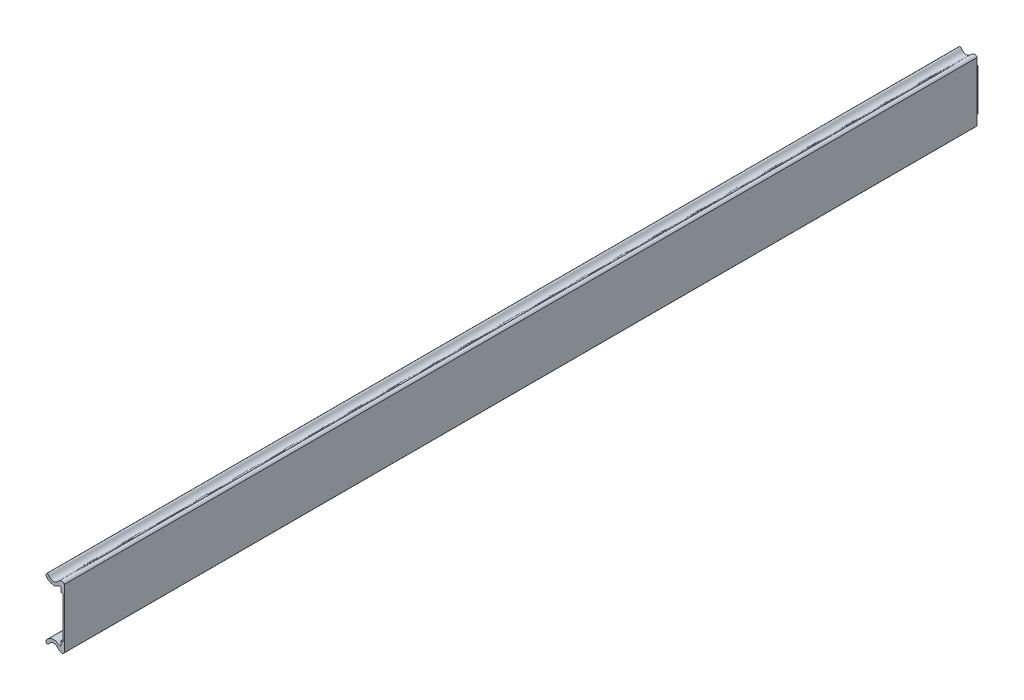
ISO-10303-21;
HEADER;
FILE_DESCRIPTION(('STEP AP214'),'2;1');
FILE_NAME('part.step','',(''),(''),'','','');
FILE_SCHEMA(('AUTOMOTIVE_DESIGN { 1 0 10303 214 1 1 1 1 }'));
ENDSEC;
DATA;
#1=APPLICATION_CONTEXT('core data for automotive mechanical design processes');
#2=APPLICATION_PROTOCOL_DEFINITION('international standard','automotive_design',2000,#1);
#3=PRODUCT_CONTEXT('',#1,'mechanical');
#4=PRODUCT('Part','Part','',(#3));
#5=PRODUCT_RELATED_PRODUCT_CATEGORY('part','',(#4));
#6=PRODUCT_DEFINITION_FORMATION('','',#4);
#7=PRODUCT_DEFINITION_CONTEXT('part definition',#1,'design');
#8=PRODUCT_DEFINITION('design','',#6,#7);
#9=PRODUCT_DEFINITION_SHAPE('','',#8);
#10=(LENGTH_UNIT() NAMED_UNIT(*) SI_UNIT(.MILLI.,.METRE.));
#11=(NAMED_UNIT(*) PLANE_ANGLE_UNIT() SI_UNIT($,.RADIAN.));
#12=(NAMED_UNIT(*) SI_UNIT($,.STERADIAN.) SOLID_ANGLE_UNIT());
#13=UNCERTAINTY_MEASURE_WITH_UNIT(LENGTH_MEASURE(1.E-05),#10,'distance_accuracy_value','');
#14=(GEOMETRIC_REPRESENTATION_CONTEXT(3) GLOBAL_UNCERTAINTY_ASSIGNED_CONTEXT((#13)) GLOBAL_UNIT_ASSIGNED_CONTEXT((#10,
#11,#12)) REPRESENTATION_CONTEXT('',''));
#15=CARTESIAN_POINT('',(0.,0.,0.));
#16=DIRECTION('',(0.,0.,1.));
#17=DIRECTION('',(1.,0.,0.));
#18=AXIS2_PLACEMENT_3D('',#15,#16,#17);
#19=CARTESIAN_POINT('',(12.3955232876,0.,-0.8));
#20=DIRECTION('',(-1.,0.,0.));
#21=DIRECTION('',(0.,0.,1.));
#22=AXIS2_PLACEMENT_3D('',#19,#20,#21);
#23=PLANE('',#22);
#24=DIRECTION('',(0.,-1.,0.));
#25=VECTOR('',#24,1.);
#26=CARTESIAN_POINT('',(12.3955232876,0.,0.));
#27=LINE('',#26,#25);
#28=CARTESIAN_POINT('',(12.3955232876,3944.3764480689,0.));
#29=VERTEX_POINT('',#28);
#30=CARTESIAN_POINT('',(12.3955232876,3928.5229508506,0.));
#31=VERTEX_POINT('',#30);
#32=EDGE_CURVE('E115',#29,#31,#27,.T.);
#33=ORIENTED_EDGE('',*,*,#32,.T.);
#34=DIRECTION('',(0.,0.,1.));
#35=VECTOR('',#34,1.);
#36=CARTESIAN_POINT('',(12.3955232876,3928.5229508506,-0.8));
#37=LINE('',#36,#35);
#38=CARTESIAN_POINT('',(12.3955232876,3928.5229508506,-0.8));
#39=VERTEX_POINT('',#38);
#40=EDGE_CURVE('E12',#39,#31,#37,.T.);
#41=ORIENTED_EDGE('',*,*,#40,.F.);
#42=DIRECTION('',(0.,-1.,0.));
#43=VECTOR('',#42,1.);
#44=CARTESIAN_POINT('',(12.3955232876,0.,-0.8));
#45=LINE('',#44,#43);
#46=CARTESIAN_POINT('',(12.3955232876,3944.3764480689,-0.8));
#47=VERTEX_POINT('',#46);
#48=EDGE_CURVE('E110',#47,#39,#45,.T.);
#49=ORIENTED_EDGE('',*,*,#48,.F.);
#50=DIRECTION('',(0.,0.,1.));
#51=VECTOR('',#50,1.);
#52=CARTESIAN_POINT('',(12.3955232876,3944.3764480689,-0.8));
#53=LINE('',#52,#51);
#54=EDGE_CURVE('E54',#47,#29,#53,.T.);
#55=ORIENTED_EDGE('',*,*,#54,.T.);
#56=EDGE_LOOP('',(#33,#41,#49,#55));
#57=FACE_BOUND('',#56,.T.);
#58=ADVANCED_FACE('F51',(#57),#23,.F.);
#59=CARTESIAN_POINT('',(0.,3928.5229508506,-0.8));
#60=DIRECTION('',(0.,1.,0.));
#61=DIRECTION('',(0.,0.,1.));
#62=AXIS2_PLACEMENT_3D('',#59,#60,#61);
#63=PLANE('',#62);
#64=DIRECTION('',(-1.,0.,0.));
#65=VECTOR('',#64,1.);
#66=CARTESIAN_POINT('',(0.,3928.5229508506,0.));
#67=LINE('',#66,#65);
#68=CARTESIAN_POINT('',(4.8646294528,3928.5229508506,0.));
#69=VERTEX_POINT('',#68);
#70=EDGE_CURVE('E90',#31,#69,#67,.T.);
#71=ORIENTED_EDGE('',*,*,#70,.T.);
#72=DIRECTION('',(0.,0.,1.));
#73=VECTOR('',#72,1.);
#74=CARTESIAN_POINT('',(4.8646294528,3928.5229508506,-0.8));
#75=LINE('',#74,#73);
#76=CARTESIAN_POINT('',(4.8646294528,3928.5229508506,-0.8));
#77=VERTEX_POINT('',#76);
#78=EDGE_CURVE('E60',#77,#69,#75,.T.);
#79=ORIENTED_EDGE('',*,*,#78,.F.);
#80=DIRECTION('',(-1.,0.,0.));
#81=VECTOR('',#80,1.);
#82=CARTESIAN_POINT('',(0.,3928.5229508506,-0.8));
#83=LINE('',#82,#81);
#84=EDGE_CURVE('E68',#39,#77,#83,.T.);
#85=ORIENTED_EDGE('',*,*,#84,.F.);
#86=ORIENTED_EDGE('',*,*,#40,.T.);
#87=EDGE_LOOP('',(#71,#79,#85,#86));
#88=FACE_BOUND('',#87,.T.);
#89=ADVANCED_FACE('F122',(#88),#63,.F.);
#90=CARTESIAN_POINT('',(4.8646294528,0.,-0.8));
#91=DIRECTION('',(-1.,0.,0.));
#92=DIRECTION('',(0.,0.,1.));
#93=AXIS2_PLACEMENT_3D('',#90,#91,#92);
#94=PLANE('',#93);
#95=DIRECTION('',(0.,-1.,0.));
#96=VECTOR('',#95,1.);
#97=CARTESIAN_POINT('',(4.8646294528,0.,0.));
#98=LINE('',#97,#96);
#99=CARTESIAN_POINT('',(4.8646294528,3944.3764480689,0.));
#100=VERTEX_POINT('',#99);
#101=EDGE_CURVE('E102',#100,#69,#98,.T.);
#102=ORIENTED_EDGE('',*,*,#101,.F.);
#103=DIRECTION('',(0.,0.,1.));
#104=VECTOR('',#103,1.);
#105=CARTESIAN_POINT('',(4.8646294528,3944.3764480689,-0.8));
#106=LINE('',#105,#104);
#107=CARTESIAN_POINT('',(4.8646294528,3944.3764480689,-0.8));
#108=VERTEX_POINT('',#107);
#109=EDGE_CURVE('E98',#108,#100,#106,.T.);
#110=ORIENTED_EDGE('',*,*,#109,.F.);
#111=DIRECTION('',(0.,-1.,0.));
#112=VECTOR('',#111,1.);
#113=CARTESIAN_POINT('',(4.8646294528,0.,-0.8));
#114=LINE('',#113,#112);
#115=EDGE_CURVE('E101',#108,#77,#114,.T.);
#116=ORIENTED_EDGE('',*,*,#115,.T.);
#117=ORIENTED_EDGE('',*,*,#78,.T.);
#118=EDGE_LOOP('',(#102,#110,#116,#117));
#119=FACE_BOUND('',#118,.T.);
#120=ADVANCED_FACE('F100',(#119),#94,.T.);
#121=CARTESIAN_POINT('',(0.,3944.3764480689,-0.8));
#122=DIRECTION('',(0.,1.,0.));
#123=DIRECTION('',(0.,0.,1.));
#124=AXIS2_PLACEMENT_3D('',#121,#122,#123);
#125=PLANE('',#124);
#126=DIRECTION('',(-1.,0.,0.));
#127=VECTOR('',#126,1.);
#128=CARTESIAN_POINT('',(0.,3944.3764480689,0.));
#129=LINE('',#128,#127);
#130=EDGE_CURVE('E118',#29,#100,#129,.T.);
#131=ORIENTED_EDGE('',*,*,#130,.F.);
#132=ORIENTED_EDGE('',*,*,#54,.F.);
#133=DIRECTION('',(-1.,0.,0.));
#134=VECTOR('',#133,1.);
#135=CARTESIAN_POINT('',(0.,3944.3764480689,-0.8));
#136=LINE('',#135,#134);
#137=EDGE_CURVE('E107',#47,#108,#136,.T.);
#138=ORIENTED_EDGE('',*,*,#137,.T.);
#139=ORIENTED_EDGE('',*,*,#109,.T.);
#140=EDGE_LOOP('',(#131,#132,#138,#139));
#141=FACE_BOUND('',#140,.T.);
#142=ADVANCED_FACE('F109',(#141),#125,.T.);
#143=CARTESIAN_POINT('',(0.,0.,-0.8));
#144=DIRECTION('',(0.,0.,1.));
#145=DIRECTION('',(1.,0.,0.));
#146=AXIS2_PLACEMENT_3D('',#143,#144,#145);
#147=PLANE('',#146);
#148=ORIENTED_EDGE('',*,*,#48,.T.);
#149=ORIENTED_EDGE('',*,*,#84,.T.);
#150=ORIENTED_EDGE('',*,*,#115,.F.);
#151=ORIENTED_EDGE('',*,*,#137,.F.);
#152=EDGE_LOOP('',(#148,#149,#150,#151));
#153=FACE_BOUND('',#152,.T.);
#154=ADVANCED_FACE('F106',(#153),#147,.F.);
#155=CARTESIAN_POINT('',(0.,0.,0.));
#156=DIRECTION('',(0.,0.,1.));
#157=DIRECTION('',(1.,0.,0.));
#158=AXIS2_PLACEMENT_3D('',#155,#156,#157);
#159=PLANE('',#158);
#160=ORIENTED_EDGE('',*,*,#32,.F.);
#161=ORIENTED_EDGE('',*,*,#130,.T.);
#162=ORIENTED_EDGE('',*,*,#101,.T.);
#163=ORIENTED_EDGE('',*,*,#70,.F.);
#164=EDGE_LOOP('',(#160,#161,#162,#163));
#165=FACE_BOUND('',#164,.T.);
#166=ADVANCED_FACE('F124',(#165),#159,.T.);
#167=CLOSED_SHELL('',(#58,#89,#120,#142,#154,#166));
#168=MANIFOLD_SOLID_BREP('B2',#167);
#169=CARTESIAN_POINT('',(12.8640816538723,1.71175669604603E-10,346.02));
#170=DIRECTION('',(-1.,-1.33064818935657E-11,0.));
#171=DIRECTION('',(1.33064818935657E-11,-1.,0.));
#172=AXIS2_PLACEMENT_3D('',#169,#170,#171);
#173=PLANE('',#172);
#174=DIRECTION('',(-1.33064818935657E-11,1.,0.));
#175=VECTOR('',#174,1.);
#176=CARTESIAN_POINT('',(12.8640816538723,1.71175669604603E-10,0.));
#177=LINE('',#176,#175);
#178=CARTESIAN_POINT('',(12.8640816016414,3925.22418959922,0.));
#179=VERTEX_POINT('',#178);
#180=CARTESIAN_POINT('',(12.8640816016414,3947.67520932027,0.));
#181=VERTEX_POINT('',#180);
#182=EDGE_CURVE('E275',#179,#181,#177,.T.);
#183=ORIENTED_EDGE('',*,*,#182,.T.);
#184=DIRECTION('',(0.,0.,-1.));
#185=VECTOR('',#184,1.);
#186=CARTESIAN_POINT('',(12.8640816016414,3947.67520932027,346.02));
#187=LINE('',#186,#185);
#188=CARTESIAN_POINT('',(12.8640816016414,3947.67520932027,346.02));
#189=VERTEX_POINT('',#188);
#190=EDGE_CURVE('E49',#189,#181,#187,.T.);
#191=ORIENTED_EDGE('',*,*,#190,.F.);
#192=DIRECTION('',(-1.33064818935657E-11,1.,0.));
#193=VECTOR('',#192,1.);
#194=CARTESIAN_POINT('',(12.8640816538723,1.71175669604603E-10,346.02));
#195=LINE('',#194,#193);
#196=CARTESIAN_POINT('',(12.8640816016414,3925.22418959922,346.02));
#197=VERTEX_POINT('',#196);
#198=EDGE_CURVE('E311',#197,#189,#195,.T.);
#199=ORIENTED_EDGE('',*,*,#198,.F.);
#200=DIRECTION('',(0.,0.,-1.));
#201=VECTOR('',#200,1.);
#202=CARTESIAN_POINT('',(12.8640816016414,3925.22418959922,346.02));
#203=LINE('',#202,#201);
#204=EDGE_CURVE('E268',#197,#179,#203,.T.);
#205=ORIENTED_EDGE('',*,*,#204,.T.);
#206=EDGE_LOOP('',(#183,#191,#199,#205));
#207=FACE_BOUND('',#206,.T.);
#208=ADVANCED_FACE('F175',(#207),#173,.F.);
#209=CARTESIAN_POINT('',(12.8640816016414,3947.67520932027,346.02));
#210=CARTESIAN_POINT('',(12.437982896546,3948.27271526491,346.02));
#211=CARTESIAN_POINT('',(12.0267976461291,3948.32433802116,346.02));
#212=CARTESIAN_POINT('',(11.6021414626916,3948.23209323564,346.02));
#213=CARTESIAN_POINT('',(11.5218869287746,3948.2064638954,346.02));
#214=CARTESIAN_POINT('',(11.2199532753806,3948.09162986358,346.02));
#215=CARTESIAN_POINT('',(11.0339179149569,3947.96989248943,346.02));
#216=CARTESIAN_POINT('',(10.740753128795,3947.72104609131,346.02));
#217=CARTESIAN_POINT('',(10.6281064540127,3947.60815073228,346.02));
#218=CARTESIAN_POINT('',(10.3932528317902,3947.36868612939,346.02));
#219=CARTESIAN_POINT('',(10.2708937062411,3947.24358789871,346.02));
#220=CARTESIAN_POINT('',(9.99619319729998,3947.00844807461,346.02));
#221=CARTESIAN_POINT('',(9.84338576844925,3946.89849474196,346.02));
#222=CARTESIAN_POINT('',(9.31284294716354,3946.62932874829,346.02));
#223=CARTESIAN_POINT('',(8.87417211100378,3946.52869183252,346.02));
#224=CARTESIAN_POINT('',(8.28770383467431,3946.59013115013,346.02));
#225=CARTESIAN_POINT('',(8.1057067422982,3946.64830481845,346.02));
#226=CARTESIAN_POINT('',(7.77361606401452,3946.81443124148,346.02));
#227=CARTESIAN_POINT('',(7.62326092198218,3946.92200153275,346.02));
#228=CARTESIAN_POINT('',(7.35719335034739,3947.15812530124,346.02));
#229=CARTESIAN_POINT('',(7.24326901352525,3947.28707104863,346.02));
#230=CARTESIAN_POINT('',(7.04140475198634,3947.53529962122,346.02));
#231=CARTESIAN_POINT('',(6.95212375768433,3947.65428824378,346.02));
#232=CARTESIAN_POINT('',(6.77457153424083,3947.84837699311,346.02));
#233=CARTESIAN_POINT('',(6.68498459853226,3947.92225127556,346.02));
#234=CARTESIAN_POINT('',(6.39377276476867,3948.03641170593,346.02));
#235=CARTESIAN_POINT('',(5.97193504672431,3947.92657605434,346.02));
#236=CARTESIAN_POINT('',(5.84836642224664,3947.42718995845,346.02));
#237=CARTESIAN_POINT('',(5.96527725445716,3946.89897200402,346.02));
#238=CARTESIAN_POINT('',(6.1517334824636,3946.62727259874,346.02));
#239=CARTESIAN_POINT('',(6.58715309673289,3946.24065110515,346.02));
#240=CARTESIAN_POINT('',(6.75895267061988,3946.11427472746,346.02));
#241=CARTESIAN_POINT('',(7.14109885043181,3945.87629748235,346.02));
#242=CARTESIAN_POINT('',(7.35007585337609,3945.76563806338,346.02));
#243=CARTESIAN_POINT('',(7.77719541995239,3945.57891745568,346.02));
#244=CARTESIAN_POINT('',(7.99511447198688,3945.50303769191,346.02));
#245=CARTESIAN_POINT('',(8.62410939642255,3945.35302621839,346.02));
#246=CARTESIAN_POINT('',(9.01578731549691,3945.35216812736,346.02));
#247=CARTESIAN_POINT('',(9.55530151186256,3945.48278674365,346.02));
#248=CARTESIAN_POINT('',(9.72719619706764,3945.54963448642,346.02));
#249=CARTESIAN_POINT('',(10.0529841653385,3945.70331286894,346.02));
#250=CARTESIAN_POINT('',(10.2068679372724,3945.7899228567,346.02));
#251=CARTESIAN_POINT('',(10.49444017793,3945.95465345165,346.02));
#252=CARTESIAN_POINT('',(10.6280287203747,3946.03182998675,346.02));
#253=CARTESIAN_POINT('',(10.9962383374716,3946.21801978175,346.02));
#254=CARTESIAN_POINT('',(11.1995258160483,3946.28219318348,346.02));
#255=CARTESIAN_POINT('',(11.5099120912567,3946.18909585752,346.02));
#256=CARTESIAN_POINT('',(11.611475075935,3946.04581871483,346.02));
#257=CARTESIAN_POINT('',(11.6036768586216,3945.88098642102,346.02));
#258=B_SPLINE_CURVE_WITH_KNOTS('',3,(#209,#210,#211,#212,#213,#214,#215,#216,#217,#218,#219,
#220,#221,#222,#223,#224,#225,#226,#227,#228,#229,#230,#231,#232,#233,#234,#235,#236,#237,#238,
#239,#240,#241,#242,#243,#244,#245,#246,#247,#248,#249,#250,#251,#252,#253,#254,#255,#256,#257),
.UNSPECIFIED.,.F.,.F.,(4,2,2,2,2,2,2,2,2,2,2,2,2,1,2,2,2,2,2,2,2,2,2,2,4),(0.,
0.0624999999998417,0.0781249999998149,0.124999999999777,0.156249999999766,0.187499999999755,
0.218749999999744,0.281249999999722,0.312499999999711,0.3437499999997,0.37499999999969,
0.406249999999678,0.437499999999667,0.499999999999695,0.562499999999721,0.624999999999748,
0.656249999999762,0.687499999999775,0.718749999999789,0.781249999999816,0.812499999999829,
0.843749999999843,0.874999999999856,0.937499999999928,1.),.UNSPECIFIED.);
#259=DIRECTION('',(0.,0.,-1.));
#260=VECTOR('',#259,1.);
#261=SURFACE_OF_LINEAR_EXTRUSION('',#258,#260);
#262=CARTESIAN_POINT('',(12.8640816016414,3947.67520932027,0.));
#263=CARTESIAN_POINT('',(12.437982896546,3948.27271526491,0.));
#264=CARTESIAN_POINT('',(12.0267976461291,3948.32433802116,0.));
#265=CARTESIAN_POINT('',(11.6021414626916,3948.23209323564,0.));
#266=CARTESIAN_POINT('',(11.5218869287746,3948.2064638954,0.));
#267=CARTESIAN_POINT('',(11.2199532753806,3948.09162986358,0.));
#268=CARTESIAN_POINT('',(11.0339179149569,3947.96989248943,0.));
#269=CARTESIAN_POINT('',(10.740753128795,3947.72104609131,0.));
#270=CARTESIAN_POINT('',(10.6281064540127,3947.60815073228,0.));
#271=CARTESIAN_POINT('',(10.3932528317902,3947.36868612939,0.));
#272=CARTESIAN_POINT('',(10.2708937062411,3947.24358789871,0.));
#273=CARTESIAN_POINT('',(9.99619319729998,3947.00844807461,0.));
#274=CARTESIAN_POINT('',(9.84338576844925,3946.89849474196,0.));
#275=CARTESIAN_POINT('',(9.31284294716354,3946.62932874829,0.));
#276=CARTESIAN_POINT('',(8.87417211100378,3946.52869183252,0.));
#277=CARTESIAN_POINT('',(8.28770383467431,3946.59013115013,0.));
#278=CARTESIAN_POINT('',(8.1057067422982,3946.64830481845,0.));
#279=CARTESIAN_POINT('',(7.77361606401452,3946.81443124148,0.));
#280=CARTESIAN_POINT('',(7.62326092198218,3946.92200153275,0.));
#281=CARTESIAN_POINT('',(7.35719335034739,3947.15812530124,0.));
#282=CARTESIAN_POINT('',(7.24326901352525,3947.28707104863,0.));
#283=CARTESIAN_POINT('',(7.04140475198634,3947.53529962122,0.));
#284=CARTESIAN_POINT('',(6.95212375768433,3947.65428824378,0.));
#285=CARTESIAN_POINT('',(6.77457153424083,3947.84837699311,0.));
#286=CARTESIAN_POINT('',(6.68498459853226,3947.92225127556,0.));
#287=CARTESIAN_POINT('',(6.39377276476867,3948.03641170593,0.));
#288=CARTESIAN_POINT('',(5.97193504672431,3947.92657605434,0.));
#289=CARTESIAN_POINT('',(5.84836642224664,3947.42718995845,0.));
#290=CARTESIAN_POINT('',(5.96527725445716,3946.89897200402,0.));
#291=CARTESIAN_POINT('',(6.1517334824636,3946.62727259874,0.));
#292=CARTESIAN_POINT('',(6.58715309673289,3946.24065110515,0.));
#293=CARTESIAN_POINT('',(6.75895267061988,3946.11427472746,0.));
#294=CARTESIAN_POINT('',(7.14109885043181,3945.87629748235,0.));
#295=CARTESIAN_POINT('',(7.35007585337609,3945.76563806338,0.));
#296=CARTESIAN_POINT('',(7.77719541995239,3945.57891745568,0.));
#297=CARTESIAN_POINT('',(7.99511447198688,3945.50303769191,0.));
#298=CARTESIAN_POINT('',(8.62410939642255,3945.35302621839,0.));
#299=CARTESIAN_POINT('',(9.01578731549691,3945.35216812736,0.));
#300=CARTESIAN_POINT('',(9.55530151186256,3945.48278674365,0.));
#301=CARTESIAN_POINT('',(9.72719619706764,3945.54963448642,0.));
#302=CARTESIAN_POINT('',(10.0529841653385,3945.70331286894,0.));
#303=CARTESIAN_POINT('',(10.2068679372724,3945.7899228567,0.));
#304=CARTESIAN_POINT('',(10.49444017793,3945.95465345165,0.));
#305=CARTESIAN_POINT('',(10.6280287203747,3946.03182998675,0.));
#306=CARTESIAN_POINT('',(10.9962383374716,3946.21801978175,0.));
#307=CARTESIAN_POINT('',(11.1995258160483,3946.28219318348,0.));
#308=CARTESIAN_POINT('',(11.5099120912567,3946.18909585752,0.));
#309=CARTESIAN_POINT('',(11.611475075935,3946.04581871483,0.));
#310=CARTESIAN_POINT('',(11.6036768586216,3945.88098642102,0.));
#311=B_SPLINE_CURVE_WITH_KNOTS('',3,(#262,#263,#264,#265,#266,#267,#268,#269,#270,#271,#272,
#273,#274,#275,#276,#277,#278,#279,#280,#281,#282,#283,#284,#285,#286,#287,#288,#289,#290,#291,
#292,#293,#294,#295,#296,#297,#298,#299,#300,#301,#302,#303,#304,#305,#306,#307,#308,#309,#310),
.UNSPECIFIED.,.F.,.F.,(4,2,2,2,2,2,2,2,2,2,2,2,2,1,2,2,2,2,2,2,2,2,2,2,4),(0.,
0.0624999999998417,0.0781249999998149,0.124999999999777,0.156249999999766,0.187499999999755,
0.218749999999744,0.281249999999722,0.312499999999711,0.3437499999997,0.37499999999969,
0.406249999999678,0.437499999999667,0.499999999999695,0.562499999999721,0.624999999999748,
0.656249999999762,0.687499999999775,0.718749999999789,0.781249999999816,0.812499999999829,
0.843749999999843,0.874999999999856,0.937499999999928,1.),.UNSPECIFIED.);
#312=CARTESIAN_POINT('',(11.6036768586216,3945.88098642102,0.));
#313=VERTEX_POINT('',#312);
#314=EDGE_CURVE('E346',#181,#313,#311,.T.);
#315=ORIENTED_EDGE('',*,*,#314,.T.);
#316=DIRECTION('',(0.,0.,-1.));
#317=VECTOR('',#316,1.);
#318=CARTESIAN_POINT('',(11.6036768586216,3945.88098642102,346.02));
#319=LINE('',#318,#317);
#320=CARTESIAN_POINT('',(11.6036768586216,3945.88098642102,346.02));
#321=VERTEX_POINT('',#320);
#322=EDGE_CURVE('E183',#321,#313,#319,.T.);
#323=ORIENTED_EDGE('',*,*,#322,.F.);
#324=EDGE_CURVE('E234',#189,#321,#258,.T.);
#325=ORIENTED_EDGE('',*,*,#324,.F.);
#326=ORIENTED_EDGE('',*,*,#190,.T.);
#327=EDGE_LOOP('',(#315,#323,#325,#326));
#328=FACE_BOUND('',#327,.T.);
#329=ADVANCED_FACE('F301',(#328),#261,.F.);
#330=CARTESIAN_POINT('',(11.6036768019703,-1.66594910266299E-10,346.02));
#331=DIRECTION('',(1.,-1.43570794938042E-11,0.));
#332=DIRECTION('',(1.43570794938042E-11,1.,0.));
#333=AXIS2_PLACEMENT_3D('',#330,#331,#332);
#334=PLANE('',#333);
#335=DIRECTION('',(-1.43570794938042E-11,-1.,0.));
#336=VECTOR('',#335,1.);
#337=CARTESIAN_POINT('',(11.6036768019703,-1.66594910266299E-10,0.));
#338=LINE('',#337,#336);
#339=CARTESIAN_POINT('',(11.6036768586108,3944.3764480689,0.));
#340=VERTEX_POINT('',#339);
#341=EDGE_CURVE('E326',#313,#340,#338,.T.);
#342=ORIENTED_EDGE('',*,*,#341,.T.);
#343=DIRECTION('',(0.,0.,-1.));
#344=VECTOR('',#343,1.);
#345=CARTESIAN_POINT('',(11.6036768586108,3944.3764480689,346.02));
#346=LINE('',#345,#344);
#347=CARTESIAN_POINT('',(11.6036768586108,3944.3764480689,346.02));
#348=VERTEX_POINT('',#347);
#349=EDGE_CURVE('E320',#348,#340,#346,.T.);
#350=ORIENTED_EDGE('',*,*,#349,.F.);
#351=DIRECTION('',(-1.43570794938042E-11,-1.,0.));
#352=VECTOR('',#351,1.);
#353=CARTESIAN_POINT('',(11.6036768019703,-1.66594910266299E-10,346.02));
#354=LINE('',#353,#352);
#355=EDGE_CURVE('E310',#321,#348,#354,.T.);
#356=ORIENTED_EDGE('',*,*,#355,.F.);
#357=ORIENTED_EDGE('',*,*,#322,.T.);
#358=EDGE_LOOP('',(#342,#350,#356,#357));
#359=FACE_BOUND('',#358,.T.);
#360=ADVANCED_FACE('F298',(#359),#334,.F.);
#361=CARTESIAN_POINT('',(0.,3944.3764480689,346.02));
#362=DIRECTION('',(0.,-1.,0.));
#363=DIRECTION('',(0.,0.,-1.));
#364=AXIS2_PLACEMENT_3D('',#361,#362,#363);
#365=PLANE('',#364);
#366=DIRECTION('',(-1.,0.,0.));
#367=VECTOR('',#366,1.);
#368=CARTESIAN_POINT('',(0.,3944.3764480689,0.));
#369=LINE('',#368,#367);
#370=CARTESIAN_POINT('',(12.3955232876,3944.3764480689,0.));
#371=VERTEX_POINT('',#370);
#372=EDGE_CURVE('E344',#371,#340,#369,.T.);
#373=ORIENTED_EDGE('',*,*,#372,.F.);
#374=DIRECTION('',(0.,0.,-1.));
#375=VECTOR('',#374,1.);
#376=CARTESIAN_POINT('',(12.3955232876,3944.3764480689,346.02));
#377=LINE('',#376,#375);
#378=CARTESIAN_POINT('',(12.3955232876,3944.3764480689,346.02));
#379=VERTEX_POINT('',#378);
#380=EDGE_CURVE('E322',#379,#371,#377,.T.);
#381=ORIENTED_EDGE('',*,*,#380,.F.);
#382=DIRECTION('',(-1.,0.,0.));
#383=VECTOR('',#382,1.);
#384=CARTESIAN_POINT('',(0.,3944.3764480689,346.02));
#385=LINE('',#384,#383);
#386=EDGE_CURVE('E316',#379,#348,#385,.T.);
#387=ORIENTED_EDGE('',*,*,#386,.T.);
#388=ORIENTED_EDGE('',*,*,#349,.T.);
#389=EDGE_LOOP('',(#373,#381,#387,#388));
#390=FACE_BOUND('',#389,.T.);
#391=ADVANCED_FACE('F294',(#390),#365,.T.);
#392=CARTESIAN_POINT('',(12.3955232876,0.,346.02));
#393=DIRECTION('',(1.,0.,0.));
#394=DIRECTION('',(0.,0.,-1.));
#395=AXIS2_PLACEMENT_3D('',#392,#393,#394);
#396=PLANE('',#395);
#397=DIRECTION('',(0.,-1.,0.));
#398=VECTOR('',#397,1.);
#399=CARTESIAN_POINT('',(12.3955232876,0.,0.));
#400=LINE('',#399,#398);
#401=CARTESIAN_POINT('',(12.3955232876,3928.52295085061,0.));
#402=VERTEX_POINT('',#401);
#403=EDGE_CURVE('E342',#371,#402,#400,.T.);
#404=ORIENTED_EDGE('',*,*,#403,.T.);
#405=DIRECTION('',(0.,0.,-1.));
#406=VECTOR('',#405,1.);
#407=CARTESIAN_POINT('',(12.3955232876,3928.52295085061,346.02));
#408=LINE('',#407,#406);
#409=CARTESIAN_POINT('',(12.3955232876,3928.52295085061,346.02));
#410=VERTEX_POINT('',#409);
#411=EDGE_CURVE('E263',#410,#402,#408,.T.);
#412=ORIENTED_EDGE('',*,*,#411,.F.);
#413=DIRECTION('',(0.,-1.,0.));
#414=VECTOR('',#413,1.);
#415=CARTESIAN_POINT('',(12.3955232876,0.,346.02));
#416=LINE('',#415,#414);
#417=EDGE_CURVE('E254',#379,#410,#416,.T.);
#418=ORIENTED_EDGE('',*,*,#417,.F.);
#419=ORIENTED_EDGE('',*,*,#380,.T.);
#420=EDGE_LOOP('',(#404,#412,#418,#419));
#421=FACE_BOUND('',#420,.T.);
#422=ADVANCED_FACE('F291',(#421),#396,.F.);
#423=CARTESIAN_POINT('',(0.,3928.5229508506,346.02));
#424=DIRECTION('',(0.,-1.,0.));
#425=DIRECTION('',(0.,0.,-1.));
#426=AXIS2_PLACEMENT_3D('',#423,#424,#425);
#427=PLANE('',#426);
#428=DIRECTION('',(-1.,0.,0.));
#429=VECTOR('',#428,1.);
#430=CARTESIAN_POINT('',(0.,3928.5229508506,0.));
#431=LINE('',#430,#429);
#432=CARTESIAN_POINT('',(11.6036768586108,3928.5229508506,0.));
#433=VERTEX_POINT('',#432);
#434=EDGE_CURVE('E262',#402,#433,#431,.T.);
#435=ORIENTED_EDGE('',*,*,#434,.T.);
#436=DIRECTION('',(0.,0.,-1.));
#437=VECTOR('',#436,1.);
#438=CARTESIAN_POINT('',(11.6036768586108,3928.5229508506,346.02));
#439=LINE('',#438,#437);
#440=CARTESIAN_POINT('',(11.6036768586108,3928.5229508506,346.02));
#441=VERTEX_POINT('',#440);
#442=EDGE_CURVE('E259',#441,#433,#439,.T.);
#443=ORIENTED_EDGE('',*,*,#442,.F.);
#444=DIRECTION('',(-1.,0.,0.));
#445=VECTOR('',#444,1.);
#446=CARTESIAN_POINT('',(0.,3928.5229508506,346.02));
#447=LINE('',#446,#445);
#448=EDGE_CURVE('E247',#410,#441,#447,.T.);
#449=ORIENTED_EDGE('',*,*,#448,.F.);
#450=ORIENTED_EDGE('',*,*,#411,.T.);
#451=EDGE_LOOP('',(#435,#443,#449,#450));
#452=FACE_BOUND('',#451,.T.);
#453=ADVANCED_FACE('F260',(#452),#427,.F.);
#454=CARTESIAN_POINT('',(11.6036769150021,1.66594911889254E-10,346.02));
#455=DIRECTION('',(1.,1.43570794938169E-11,0.));
#456=DIRECTION('',(-1.43570794938169E-11,1.,0.));
#457=AXIS2_PLACEMENT_3D('',#454,#455,#456);
#458=PLANE('',#457);
#459=DIRECTION('',(1.43570794938169E-11,-1.,0.));
#460=VECTOR('',#459,1.);
#461=CARTESIAN_POINT('',(11.6036769150021,1.66594911889254E-10,0.));
#462=LINE('',#461,#460);
#463=CARTESIAN_POINT('',(11.6036768586216,3927.01841249848,0.));
#464=VERTEX_POINT('',#463);
#465=EDGE_CURVE('E220',#433,#464,#462,.T.);
#466=ORIENTED_EDGE('',*,*,#465,.T.);
#467=DIRECTION('',(0.,0.,-1.));
#468=VECTOR('',#467,1.);
#469=CARTESIAN_POINT('',(11.6036768586216,3927.01841249848,346.02));
#470=LINE('',#469,#468);
#471=CARTESIAN_POINT('',(11.6036768586216,3927.01841249848,346.02));
#472=VERTEX_POINT('',#471);
#473=EDGE_CURVE('E264',#472,#464,#470,.T.);
#474=ORIENTED_EDGE('',*,*,#473,.F.);
#475=DIRECTION('',(1.43570794938169E-11,-1.,0.));
#476=VECTOR('',#475,1.);
#477=CARTESIAN_POINT('',(11.6036769150021,1.66594911889254E-10,346.02));
#478=LINE('',#477,#476);
#479=EDGE_CURVE('E251',#441,#472,#478,.T.);
#480=ORIENTED_EDGE('',*,*,#479,.F.);
#481=ORIENTED_EDGE('',*,*,#442,.T.);
#482=EDGE_LOOP('',(#466,#474,#480,#481));
#483=FACE_BOUND('',#482,.T.);
#484=ADVANCED_FACE('F266',(#483),#458,.F.);
#485=CARTESIAN_POINT('',(11.6036768586216,3927.01841249848,346.02));
#486=CARTESIAN_POINT('',(11.611475075935,3926.85358020467,346.02));
#487=CARTESIAN_POINT('',(11.5099120912567,3926.71030306198,346.02));
#488=CARTESIAN_POINT('',(11.1995258160483,3926.61720573602,346.02));
#489=CARTESIAN_POINT('',(10.9962383374716,3926.68137913774,346.02));
#490=CARTESIAN_POINT('',(10.6280287203748,3926.86756893274,346.02));
#491=CARTESIAN_POINT('',(10.49444017793,3926.94474546784,346.02));
#492=CARTESIAN_POINT('',(10.2068679372724,3927.1094760628,346.02));
#493=CARTESIAN_POINT('',(10.0529841653385,3927.19608605056,346.02));
#494=CARTESIAN_POINT('',(9.72719619706766,3927.34976443308,346.02));
#495=CARTESIAN_POINT('',(9.55530151186257,3927.41661217585,346.02));
#496=CARTESIAN_POINT('',(9.01578731549692,3927.54723079213,346.02));
#497=CARTESIAN_POINT('',(8.62410939642255,3927.5463727011,346.02));
#498=CARTESIAN_POINT('',(7.99511447198687,3927.39636122759,346.02));
#499=CARTESIAN_POINT('',(7.7771954199524,3927.32048146382,346.02));
#500=CARTESIAN_POINT('',(7.3500758533761,3927.13376085612,346.02));
#501=CARTESIAN_POINT('',(7.14109885043181,3927.02310143715,346.02));
#502=CARTESIAN_POINT('',(6.75895267061988,3926.78512419204,346.02));
#503=CARTESIAN_POINT('',(6.5871530967329,3926.65874781435,346.02));
#504=CARTESIAN_POINT('',(6.15173348246361,3926.27212632076,346.02));
#505=CARTESIAN_POINT('',(5.96527725445716,3926.00042691547,346.02));
#506=CARTESIAN_POINT('',(5.84836642224664,3925.47220896105,346.02));
#507=CARTESIAN_POINT('',(5.97193504672427,3924.97282286516,346.02));
#508=CARTESIAN_POINT('',(6.39377276476871,3924.86298721357,346.02));
#509=CARTESIAN_POINT('',(6.68498459853231,3924.97714764395,346.02));
#510=CARTESIAN_POINT('',(6.77457153424088,3925.05102192639,346.02));
#511=CARTESIAN_POINT('',(6.95212375768438,3925.24511067572,346.02));
#512=CARTESIAN_POINT('',(7.04140475198639,3925.36409929827,346.02));
#513=CARTESIAN_POINT('',(7.24326901352531,3925.61232787086,346.02));
#514=CARTESIAN_POINT('',(7.35719335034746,3925.74127361826,346.02));
#515=CARTESIAN_POINT('',(7.62326092198227,3925.97739738674,346.02));
#516=CARTESIAN_POINT('',(7.77361606401461,3926.08496767802,346.02));
#517=CARTESIAN_POINT('',(8.10570674229831,3926.25109410105,346.02));
#518=CARTESIAN_POINT('',(8.28770383467443,3926.30926776937,346.02));
#519=CARTESIAN_POINT('',(8.87417211100388,3926.37070708697,346.02));
#520=CARTESIAN_POINT('',(9.31284294716358,3926.2700701712,346.02));
#521=CARTESIAN_POINT('',(9.84338576844924,3926.00090417754,346.02));
#522=CARTESIAN_POINT('',(9.99619319729999,3925.8909508449,346.02));
#523=CARTESIAN_POINT('',(10.2708937062411,3925.65581102079,346.02));
#524=CARTESIAN_POINT('',(10.3932528317902,3925.53071279011,346.02));
#525=CARTESIAN_POINT('',(10.6281064540127,3925.29124818722,346.02));
#526=CARTESIAN_POINT('',(10.740753128795,3925.1783528282,346.02));
#527=CARTESIAN_POINT('',(11.0339179149569,3924.92950643007,346.02));
#528=CARTESIAN_POINT('',(11.2199532753808,3924.80776905592,346.02));
#529=CARTESIAN_POINT('',(11.5218869287746,3924.69293502409,346.02));
#530=CARTESIAN_POINT('',(11.6021414626916,3924.66730568385,346.02));
#531=CARTESIAN_POINT('',(12.0267976461291,3924.57506089834,346.02));
#532=CARTESIAN_POINT('',(12.437982896546,3924.62668365458,346.02));
#533=CARTESIAN_POINT('',(12.8640816016414,3925.22418959922,346.02));
#534=B_SPLINE_CURVE_WITH_KNOTS('',3,(#485,#486,#487,#488,#489,#490,#491,#492,#493,#494,#495,
#496,#497,#498,#499,#500,#501,#502,#503,#504,#505,#506,#507,#508,#509,#510,#511,#512,#513,#514,
#515,#516,#517,#518,#519,#520,#521,#522,#523,#524,#525,#526,#527,#528,#529,#530,#531,#532,#533),
.UNSPECIFIED.,.F.,.F.,(4,2,2,2,2,2,2,2,2,2,2,1,2,2,2,2,2,2,2,2,2,2,2,2,4),(0.,
0.0625000000000062,0.125000000000012,0.156250000000015,0.187500000000019,0.218750000000022,
0.281250000000028,0.312500000000031,0.343750000000034,0.375000000000037,0.437499999999996,
0.499999999999955,0.562499999999914,0.593749999999917,0.624999999999921,0.656249999999924,
0.687499999999928,0.718749999999932,0.781249999999939,0.812499999999943,0.843749999999947,
0.874999999999951,0.921874999999957,0.937499999999959,1.),.UNSPECIFIED.);
#535=DIRECTION('',(0.,0.,-1.));
#536=VECTOR('',#535,1.);
#537=SURFACE_OF_LINEAR_EXTRUSION('',#534,#536);
#538=CARTESIAN_POINT('',(11.6036768586216,3927.01841249848,0.));
#539=CARTESIAN_POINT('',(11.611475075935,3926.85358020467,0.));
#540=CARTESIAN_POINT('',(11.5099120912567,3926.71030306198,0.));
#541=CARTESIAN_POINT('',(11.1995258160483,3926.61720573602,0.));
#542=CARTESIAN_POINT('',(10.9962383374716,3926.68137913774,0.));
#543=CARTESIAN_POINT('',(10.6280287203748,3926.86756893274,0.));
#544=CARTESIAN_POINT('',(10.49444017793,3926.94474546784,0.));
#545=CARTESIAN_POINT('',(10.2068679372724,3927.1094760628,0.));
#546=CARTESIAN_POINT('',(10.0529841653385,3927.19608605056,0.));
#547=CARTESIAN_POINT('',(9.72719619706766,3927.34976443308,0.));
#548=CARTESIAN_POINT('',(9.55530151186257,3927.41661217585,0.));
#549=CARTESIAN_POINT('',(9.01578731549692,3927.54723079213,0.));
#550=CARTESIAN_POINT('',(8.62410939642255,3927.5463727011,0.));
#551=CARTESIAN_POINT('',(7.99511447198687,3927.39636122759,0.));
#552=CARTESIAN_POINT('',(7.7771954199524,3927.32048146382,0.));
#553=CARTESIAN_POINT('',(7.3500758533761,3927.13376085612,0.));
#554=CARTESIAN_POINT('',(7.14109885043181,3927.02310143715,0.));
#555=CARTESIAN_POINT('',(6.75895267061988,3926.78512419204,0.));
#556=CARTESIAN_POINT('',(6.5871530967329,3926.65874781435,0.));
#557=CARTESIAN_POINT('',(6.15173348246361,3926.27212632076,0.));
#558=CARTESIAN_POINT('',(5.96527725445716,3926.00042691547,0.));
#559=CARTESIAN_POINT('',(5.84836642224664,3925.47220896105,0.));
#560=CARTESIAN_POINT('',(5.97193504672427,3924.97282286516,0.));
#561=CARTESIAN_POINT('',(6.39377276476871,3924.86298721357,0.));
#562=CARTESIAN_POINT('',(6.68498459853231,3924.97714764395,0.));
#563=CARTESIAN_POINT('',(6.77457153424088,3925.05102192639,0.));
#564=CARTESIAN_POINT('',(6.95212375768438,3925.24511067572,0.));
#565=CARTESIAN_POINT('',(7.04140475198639,3925.36409929827,0.));
#566=CARTESIAN_POINT('',(7.24326901352531,3925.61232787086,0.));
#567=CARTESIAN_POINT('',(7.35719335034746,3925.74127361826,0.));
#568=CARTESIAN_POINT('',(7.62326092198227,3925.97739738674,0.));
#569=CARTESIAN_POINT('',(7.77361606401461,3926.08496767802,0.));
#570=CARTESIAN_POINT('',(8.10570674229831,3926.25109410105,0.));
#571=CARTESIAN_POINT('',(8.28770383467443,3926.30926776937,0.));
#572=CARTESIAN_POINT('',(8.87417211100388,3926.37070708697,0.));
#573=CARTESIAN_POINT('',(9.31284294716358,3926.2700701712,0.));
#574=CARTESIAN_POINT('',(9.84338576844924,3926.00090417754,0.));
#575=CARTESIAN_POINT('',(9.99619319729999,3925.8909508449,0.));
#576=CARTESIAN_POINT('',(10.2708937062411,3925.65581102079,0.));
#577=CARTESIAN_POINT('',(10.3932528317902,3925.53071279011,0.));
#578=CARTESIAN_POINT('',(10.6281064540127,3925.29124818722,0.));
#579=CARTESIAN_POINT('',(10.740753128795,3925.1783528282,0.));
#580=CARTESIAN_POINT('',(11.0339179149569,3924.92950643007,0.));
#581=CARTESIAN_POINT('',(11.2199532753808,3924.80776905592,0.));
#582=CARTESIAN_POINT('',(11.5218869287746,3924.69293502409,0.));
#583=CARTESIAN_POINT('',(11.6021414626916,3924.66730568385,0.));
#584=CARTESIAN_POINT('',(12.0267976461291,3924.57506089834,0.));
#585=CARTESIAN_POINT('',(12.437982896546,3924.62668365458,0.));
#586=CARTESIAN_POINT('',(12.8640816016414,3925.22418959922,0.));
#587=B_SPLINE_CURVE_WITH_KNOTS('',3,(#538,#539,#540,#541,#542,#543,#544,#545,#546,#547,#548,
#549,#550,#551,#552,#553,#554,#555,#556,#557,#558,#559,#560,#561,#562,#563,#564,#565,#566,#567,
#568,#569,#570,#571,#572,#573,#574,#575,#576,#577,#578,#579,#580,#581,#582,#583,#584,#585,#586),
.UNSPECIFIED.,.F.,.F.,(4,2,2,2,2,2,2,2,2,2,2,1,2,2,2,2,2,2,2,2,2,2,2,2,4),(0.,
0.0625000000000062,0.125000000000012,0.156250000000015,0.187500000000019,0.218750000000022,
0.281250000000028,0.312500000000031,0.343750000000034,0.375000000000037,0.437499999999996,
0.499999999999955,0.562499999999914,0.593749999999917,0.624999999999921,0.656249999999924,
0.687499999999928,0.718749999999932,0.781249999999939,0.812499999999943,0.843749999999947,
0.874999999999951,0.921874999999957,0.937499999999959,1.),.UNSPECIFIED.);
#588=EDGE_CURVE('E226',#464,#179,#587,.T.);
#589=ORIENTED_EDGE('',*,*,#588,.T.);
#590=ORIENTED_EDGE('',*,*,#204,.F.);
#591=EDGE_CURVE('E191',#472,#197,#534,.T.);
#592=ORIENTED_EDGE('',*,*,#591,.F.);
#593=ORIENTED_EDGE('',*,*,#473,.T.);
#594=EDGE_LOOP('',(#589,#590,#592,#593));
#595=FACE_BOUND('',#594,.T.);
#596=ADVANCED_FACE('F281',(#595),#537,.F.);
#597=CARTESIAN_POINT('',(0.,0.,346.02));
#598=DIRECTION('',(0.,0.,1.));
#599=DIRECTION('',(1.,0.,0.));
#600=AXIS2_PLACEMENT_3D('',#597,#598,#599);
#601=PLANE('',#600);
#602=ORIENTED_EDGE('',*,*,#198,.T.);
#603=ORIENTED_EDGE('',*,*,#324,.T.);
#604=ORIENTED_EDGE('',*,*,#355,.T.);
#605=ORIENTED_EDGE('',*,*,#386,.F.);
#606=ORIENTED_EDGE('',*,*,#417,.T.);
#607=ORIENTED_EDGE('',*,*,#448,.T.);
#608=ORIENTED_EDGE('',*,*,#479,.T.);
#609=ORIENTED_EDGE('',*,*,#591,.T.);
#610=EDGE_LOOP('',(#602,#603,#604,#605,#606,#607,#608,#609));
#611=FACE_BOUND('',#610,.T.);
#612=ADVANCED_FACE('F249',(#611),#601,.T.);
#613=CARTESIAN_POINT('',(0.,0.,0.));
#614=DIRECTION('',(0.,0.,1.));
#615=DIRECTION('',(1.,0.,0.));
#616=AXIS2_PLACEMENT_3D('',#613,#614,#615);
#617=PLANE('',#616);
#618=ORIENTED_EDGE('',*,*,#182,.F.);
#619=ORIENTED_EDGE('',*,*,#588,.F.);
#620=ORIENTED_EDGE('',*,*,#465,.F.);
#621=ORIENTED_EDGE('',*,*,#434,.F.);
#622=ORIENTED_EDGE('',*,*,#403,.F.);
#623=ORIENTED_EDGE('',*,*,#372,.T.);
#624=ORIENTED_EDGE('',*,*,#341,.F.);
#625=ORIENTED_EDGE('',*,*,#314,.F.);
#626=EDGE_LOOP('',(#618,#619,#620,#621,#622,#623,#624,#625));
#627=FACE_BOUND('',#626,.T.);
#628=ADVANCED_FACE('F285',(#627),#617,.F.);
#629=CLOSED_SHELL('',(#208,#329,#360,#391,#422,#453,#484,#596,#612,#628));
#630=MANIFOLD_SOLID_BREP('B6',#629);
#631=ADVANCED_BREP_SHAPE_REPRESENTATION('',(#18,#168,#630),#14);
#632=SHAPE_DEFINITION_REPRESENTATION(#9,#631);
ENDSEC;
END-ISO-10303-21;
